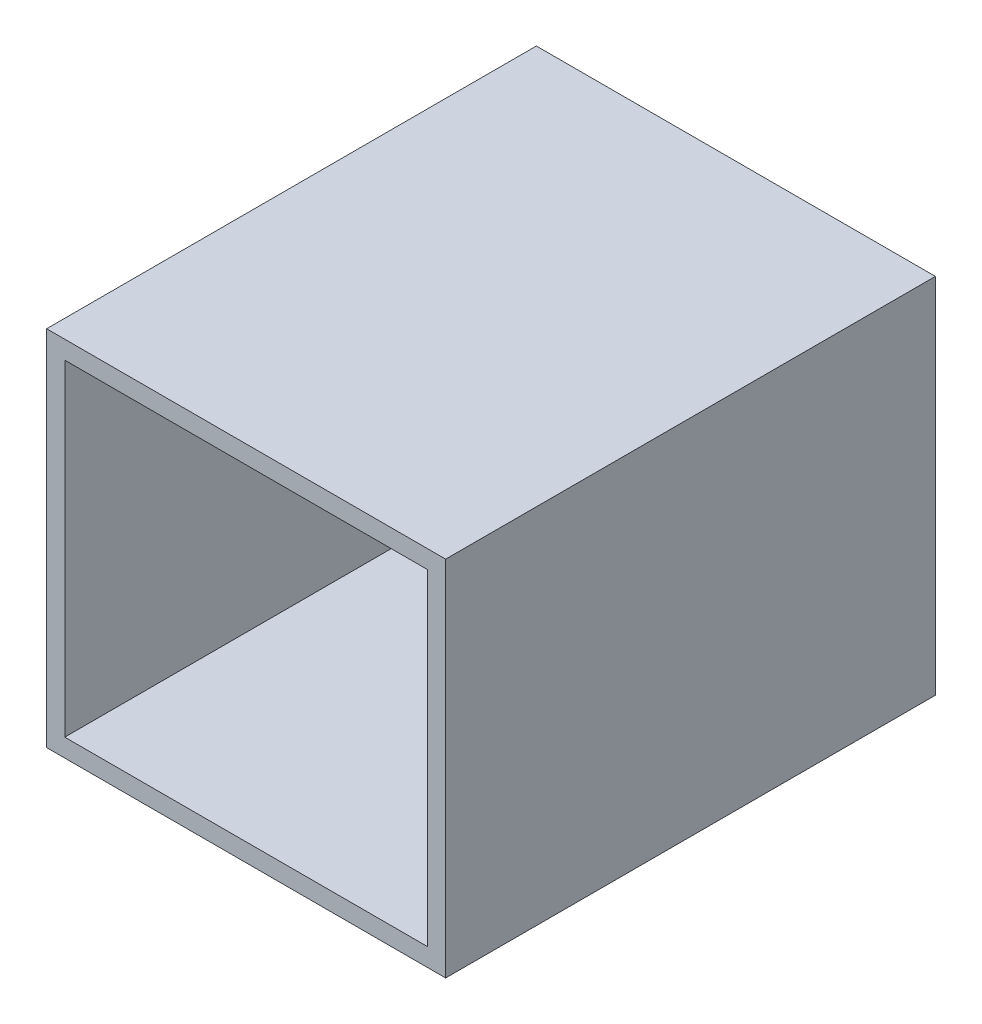
ISO-10303-21;
HEADER;
FILE_DESCRIPTION(('STEP AP214'),'2;1');
FILE_NAME('part.step','',(''),(''),'','','');
FILE_SCHEMA(('AUTOMOTIVE_DESIGN { 1 0 10303 214 1 1 1 1 }'));
ENDSEC;
DATA;
#1=APPLICATION_CONTEXT('core data for automotive mechanical design processes');
#2=APPLICATION_PROTOCOL_DEFINITION('international standard','automotive_design',2000,#1);
#3=PRODUCT_CONTEXT('',#1,'mechanical');
#4=PRODUCT('Part','Part','',(#3));
#5=PRODUCT_RELATED_PRODUCT_CATEGORY('part','',(#4));
#6=PRODUCT_DEFINITION_FORMATION('','',#4);
#7=PRODUCT_DEFINITION_CONTEXT('part definition',#1,'design');
#8=PRODUCT_DEFINITION('design','',#6,#7);
#9=PRODUCT_DEFINITION_SHAPE('','',#8);
#10=(LENGTH_UNIT() NAMED_UNIT(*) SI_UNIT(.MILLI.,.METRE.));
#11=(NAMED_UNIT(*) PLANE_ANGLE_UNIT() SI_UNIT($,.RADIAN.));
#12=(NAMED_UNIT(*) SI_UNIT($,.STERADIAN.) SOLID_ANGLE_UNIT());
#13=UNCERTAINTY_MEASURE_WITH_UNIT(LENGTH_MEASURE(1.E-05),#10,'distance_accuracy_value','');
#14=(GEOMETRIC_REPRESENTATION_CONTEXT(3) GLOBAL_UNCERTAINTY_ASSIGNED_CONTEXT((#13)) GLOBAL_UNIT_ASSIGNED_CONTEXT((#10,
#11,#12)) REPRESENTATION_CONTEXT('',''));
#15=CARTESIAN_POINT('',(0.,0.,0.));
#16=DIRECTION('',(0.,0.,1.));
#17=DIRECTION('',(1.,0.,0.));
#18=AXIS2_PLACEMENT_3D('',#15,#16,#17);
#19=CARTESIAN_POINT('',(11.,-10.,10.));
#20=DIRECTION('',(-1.,0.,0.));
#21=DIRECTION('',(0.,0.,1.));
#22=AXIS2_PLACEMENT_3D('',#19,#20,#21);
#23=PLANE('',#22);
#24=DIRECTION('',(0.,1.,0.));
#25=VECTOR('',#24,1.);
#26=CARTESIAN_POINT('',(11.,0.,-1.));
#27=LINE('',#26,#25);
#28=CARTESIAN_POINT('',(11.,-10.,-1.));
#29=VERTEX_POINT('',#28);
#30=CARTESIAN_POINT('',(11.,10.,-1.));
#31=VERTEX_POINT('',#30);
#32=EDGE_CURVE('E147',#29,#31,#27,.T.);
#33=ORIENTED_EDGE('',*,*,#32,.T.);
#34=DIRECTION('',(0.,0.,-1.));
#35=VECTOR('',#34,1.);
#36=CARTESIAN_POINT('',(11.,10.,10.));
#37=LINE('',#36,#35);
#38=CARTESIAN_POINT('',(11.,10.,26.));
#39=VERTEX_POINT('',#38);
#40=EDGE_CURVE('E11',#39,#31,#37,.T.);
#41=ORIENTED_EDGE('',*,*,#40,.F.);
#42=DIRECTION('',(0.,1.,0.));
#43=VECTOR('',#42,1.);
#44=CARTESIAN_POINT('',(11.,-10.,26.));
#45=LINE('',#44,#43);
#46=CARTESIAN_POINT('',(11.,-10.,26.));
#47=VERTEX_POINT('',#46);
#48=EDGE_CURVE('E125',#47,#39,#45,.T.);
#49=ORIENTED_EDGE('',*,*,#48,.F.);
#50=DIRECTION('',(0.,0.,-1.));
#51=VECTOR('',#50,1.);
#52=CARTESIAN_POINT('',(11.,-10.,10.));
#53=LINE('',#52,#51);
#54=EDGE_CURVE('E106',#47,#29,#53,.T.);
#55=ORIENTED_EDGE('',*,*,#54,.T.);
#56=EDGE_LOOP('',(#33,#41,#49,#55));
#57=FACE_BOUND('',#56,.T.);
#58=ADVANCED_FACE('F35',(#57),#23,.F.);
#59=CARTESIAN_POINT('',(-11.,10.,10.));
#60=DIRECTION('',(0.,-1.,0.));
#61=DIRECTION('',(0.,0.,-1.));
#62=AXIS2_PLACEMENT_3D('',#59,#60,#61);
#63=PLANE('',#62);
#64=DIRECTION('',(1.,0.,0.));
#65=VECTOR('',#64,1.);
#66=CARTESIAN_POINT('',(0.,10.,-1.));
#67=LINE('',#66,#65);
#68=CARTESIAN_POINT('',(-11.,10.,-1.));
#69=VERTEX_POINT('',#68);
#70=EDGE_CURVE('E150',#69,#31,#67,.T.);
#71=ORIENTED_EDGE('',*,*,#70,.F.);
#72=DIRECTION('',(0.,0.,-1.));
#73=VECTOR('',#72,1.);
#74=CARTESIAN_POINT('',(-11.,10.,10.));
#75=LINE('',#74,#73);
#76=CARTESIAN_POINT('',(-11.,10.,26.));
#77=VERTEX_POINT('',#76);
#78=EDGE_CURVE('E42',#77,#69,#75,.T.);
#79=ORIENTED_EDGE('',*,*,#78,.F.);
#80=DIRECTION('',(-1.,0.,0.));
#81=VECTOR('',#80,1.);
#82=CARTESIAN_POINT('',(-11.,10.,26.));
#83=LINE('',#82,#81);
#84=EDGE_CURVE('E128',#39,#77,#83,.T.);
#85=ORIENTED_EDGE('',*,*,#84,.F.);
#86=ORIENTED_EDGE('',*,*,#40,.T.);
#87=EDGE_LOOP('',(#71,#79,#85,#86));
#88=FACE_BOUND('',#87,.T.);
#89=ADVANCED_FACE('F170',(#88),#63,.F.);
#90=CARTESIAN_POINT('',(-11.,-10.,10.));
#91=DIRECTION('',(1.,0.,0.));
#92=DIRECTION('',(0.,0.,-1.));
#93=AXIS2_PLACEMENT_3D('',#90,#91,#92);
#94=PLANE('',#93);
#95=DIRECTION('',(0.,1.,0.));
#96=VECTOR('',#95,1.);
#97=CARTESIAN_POINT('',(-11.,0.,-1.));
#98=LINE('',#97,#96);
#99=CARTESIAN_POINT('',(-11.,-10.,-1.));
#100=VERTEX_POINT('',#99);
#101=EDGE_CURVE('E153',#100,#69,#98,.T.);
#102=ORIENTED_EDGE('',*,*,#101,.F.);
#103=DIRECTION('',(0.,0.,-1.));
#104=VECTOR('',#103,1.);
#105=CARTESIAN_POINT('',(-11.,-10.,10.));
#106=LINE('',#105,#104);
#107=CARTESIAN_POINT('',(-11.,-10.,26.));
#108=VERTEX_POINT('',#107);
#109=EDGE_CURVE('E161',#108,#100,#106,.T.);
#110=ORIENTED_EDGE('',*,*,#109,.F.);
#111=DIRECTION('',(0.,-1.,0.));
#112=VECTOR('',#111,1.);
#113=CARTESIAN_POINT('',(-11.,-10.,26.));
#114=LINE('',#113,#112);
#115=EDGE_CURVE('E131',#77,#108,#114,.T.);
#116=ORIENTED_EDGE('',*,*,#115,.F.);
#117=ORIENTED_EDGE('',*,*,#78,.T.);
#118=EDGE_LOOP('',(#102,#110,#116,#117));
#119=FACE_BOUND('',#118,.T.);
#120=ADVANCED_FACE('F166',(#119),#94,.F.);
#121=CARTESIAN_POINT('',(-11.,-10.,10.));
#122=DIRECTION('',(0.,1.,0.));
#123=DIRECTION('',(0.,0.,1.));
#124=AXIS2_PLACEMENT_3D('',#121,#122,#123);
#125=PLANE('',#124);
#126=DIRECTION('',(1.,0.,0.));
#127=VECTOR('',#126,1.);
#128=CARTESIAN_POINT('',(0.,-10.,-1.));
#129=LINE('',#128,#127);
#130=EDGE_CURVE('E144',#100,#29,#129,.T.);
#131=ORIENTED_EDGE('',*,*,#130,.T.);
#132=ORIENTED_EDGE('',*,*,#54,.F.);
#133=DIRECTION('',(1.,0.,0.));
#134=VECTOR('',#133,1.);
#135=CARTESIAN_POINT('',(-11.,-10.,26.));
#136=LINE('',#135,#134);
#137=EDGE_CURVE('E134',#108,#47,#136,.T.);
#138=ORIENTED_EDGE('',*,*,#137,.F.);
#139=ORIENTED_EDGE('',*,*,#109,.T.);
#140=EDGE_LOOP('',(#131,#132,#138,#139));
#141=FACE_BOUND('',#140,.T.);
#142=ADVANCED_FACE('F175',(#141),#125,.F.);
#143=CARTESIAN_POINT('',(0.,0.,-1.));
#144=DIRECTION('',(0.,0.,1.));
#145=DIRECTION('',(1.,0.,0.));
#146=AXIS2_PLACEMENT_3D('',#143,#144,#145);
#147=PLANE('',#146);
#148=ORIENTED_EDGE('',*,*,#130,.F.);
#149=ORIENTED_EDGE('',*,*,#101,.T.);
#150=ORIENTED_EDGE('',*,*,#70,.T.);
#151=ORIENTED_EDGE('',*,*,#32,.F.);
#152=EDGE_LOOP('',(#148,#149,#150,#151));
#153=FACE_BOUND('',#152,.T.);
#154=ADVANCED_FACE('F173',(#153),#147,.F.);
#155=CARTESIAN_POINT('',(0.,0.,26.));
#156=DIRECTION('',(0.,0.,-1.));
#157=DIRECTION('',(-1.,0.,0.));
#158=AXIS2_PLACEMENT_3D('',#155,#156,#157);
#159=PLANE('',#158);
#160=ORIENTED_EDGE('',*,*,#48,.T.);
#161=ORIENTED_EDGE('',*,*,#84,.T.);
#162=ORIENTED_EDGE('',*,*,#115,.T.);
#163=ORIENTED_EDGE('',*,*,#137,.T.);
#164=EDGE_LOOP('',(#160,#161,#162,#163));
#165=FACE_BOUND('',#164,.T.);
#166=DIRECTION('',(0.,1.,0.));
#167=VECTOR('',#166,1.);
#168=CARTESIAN_POINT('',(10.,-9.,26.));
#169=LINE('',#168,#167);
#170=CARTESIAN_POINT('',(10.,-9.,26.));
#171=VERTEX_POINT('',#170);
#172=CARTESIAN_POINT('',(10.,9.,26.));
#173=VERTEX_POINT('',#172);
#174=EDGE_CURVE('E110',#171,#173,#169,.T.);
#175=ORIENTED_EDGE('',*,*,#174,.F.);
#176=DIRECTION('',(1.,0.,0.));
#177=VECTOR('',#176,1.);
#178=CARTESIAN_POINT('',(-10.,-9.,26.));
#179=LINE('',#178,#177);
#180=CARTESIAN_POINT('',(-10.,-9.,26.));
#181=VERTEX_POINT('',#180);
#182=EDGE_CURVE('E121',#181,#171,#179,.T.);
#183=ORIENTED_EDGE('',*,*,#182,.F.);
#184=DIRECTION('',(0.,-1.,0.));
#185=VECTOR('',#184,1.);
#186=CARTESIAN_POINT('',(-10.,-9.,26.));
#187=LINE('',#186,#185);
#188=CARTESIAN_POINT('',(-10.,9.,26.));
#189=VERTEX_POINT('',#188);
#190=EDGE_CURVE('E119',#189,#181,#187,.T.);
#191=ORIENTED_EDGE('',*,*,#190,.F.);
#192=DIRECTION('',(-1.,0.,0.));
#193=VECTOR('',#192,1.);
#194=CARTESIAN_POINT('',(-10.,9.,26.));
#195=LINE('',#194,#193);
#196=EDGE_CURVE('E101',#173,#189,#195,.T.);
#197=ORIENTED_EDGE('',*,*,#196,.F.);
#198=EDGE_LOOP('',(#175,#183,#191,#197));
#199=FACE_BOUND('',#198,.T.);
#200=ADVANCED_FACE('F117',(#165,#199),#159,.F.);
#201=CARTESIAN_POINT('',(0.,0.,0.));
#202=DIRECTION('',(0.,0.,1.));
#203=DIRECTION('',(1.,0.,0.));
#204=AXIS2_PLACEMENT_3D('',#201,#202,#203);
#205=PLANE('',#204);
#206=DIRECTION('',(1.,0.,0.));
#207=VECTOR('',#206,1.);
#208=CARTESIAN_POINT('',(0.,-9.,0.));
#209=LINE('',#208,#207);
#210=CARTESIAN_POINT('',(-10.,-9.,0.));
#211=VERTEX_POINT('',#210);
#212=CARTESIAN_POINT('',(10.,-9.,0.));
#213=VERTEX_POINT('',#212);
#214=EDGE_CURVE('E137',#211,#213,#209,.T.);
#215=ORIENTED_EDGE('',*,*,#214,.T.);
#216=DIRECTION('',(0.,1.,0.));
#217=VECTOR('',#216,1.);
#218=CARTESIAN_POINT('',(10.,0.,0.));
#219=LINE('',#218,#217);
#220=CARTESIAN_POINT('',(10.,9.,0.));
#221=VERTEX_POINT('',#220);
#222=EDGE_CURVE('E140',#213,#221,#219,.T.);
#223=ORIENTED_EDGE('',*,*,#222,.T.);
#224=DIRECTION('',(1.,0.,0.));
#225=VECTOR('',#224,1.);
#226=CARTESIAN_POINT('',(0.,9.,0.));
#227=LINE('',#226,#225);
#228=CARTESIAN_POINT('',(-10.,9.,0.));
#229=VERTEX_POINT('',#228);
#230=EDGE_CURVE('E49',#229,#221,#227,.T.);
#231=ORIENTED_EDGE('',*,*,#230,.F.);
#232=DIRECTION('',(0.,1.,0.));
#233=VECTOR('',#232,1.);
#234=CARTESIAN_POINT('',(-10.,0.,0.));
#235=LINE('',#234,#233);
#236=EDGE_CURVE('E57',#211,#229,#235,.T.);
#237=ORIENTED_EDGE('',*,*,#236,.F.);
#238=EDGE_LOOP('',(#215,#223,#231,#237));
#239=FACE_BOUND('',#238,.T.);
#240=ADVANCED_FACE('F202',(#239),#205,.T.);
#241=CARTESIAN_POINT('',(-10.,-9.,10.));
#242=DIRECTION('',(0.,1.,0.));
#243=DIRECTION('',(0.,0.,1.));
#244=AXIS2_PLACEMENT_3D('',#241,#242,#243);
#245=PLANE('',#244);
#246=ORIENTED_EDGE('',*,*,#214,.F.);
#247=DIRECTION('',(0.,0.,-1.));
#248=VECTOR('',#247,1.);
#249=CARTESIAN_POINT('',(-10.,-9.,10.));
#250=LINE('',#249,#248);
#251=EDGE_CURVE('E157',#181,#211,#250,.T.);
#252=ORIENTED_EDGE('',*,*,#251,.F.);
#253=ORIENTED_EDGE('',*,*,#182,.T.);
#254=DIRECTION('',(0.,0.,-1.));
#255=VECTOR('',#254,1.);
#256=CARTESIAN_POINT('',(10.,-9.,10.));
#257=LINE('',#256,#255);
#258=EDGE_CURVE('E112',#171,#213,#257,.T.);
#259=ORIENTED_EDGE('',*,*,#258,.T.);
#260=EDGE_LOOP('',(#246,#252,#253,#259));
#261=FACE_BOUND('',#260,.T.);
#262=ADVANCED_FACE('F199',(#261),#245,.T.);
#263=CARTESIAN_POINT('',(-10.,-9.,10.));
#264=DIRECTION('',(1.,0.,0.));
#265=DIRECTION('',(0.,0.,-1.));
#266=AXIS2_PLACEMENT_3D('',#263,#264,#265);
#267=PLANE('',#266);
#268=ORIENTED_EDGE('',*,*,#236,.T.);
#269=DIRECTION('',(0.,0.,-1.));
#270=VECTOR('',#269,1.);
#271=CARTESIAN_POINT('',(-10.,9.,10.));
#272=LINE('',#271,#270);
#273=EDGE_CURVE('E107',#189,#229,#272,.T.);
#274=ORIENTED_EDGE('',*,*,#273,.F.);
#275=ORIENTED_EDGE('',*,*,#190,.T.);
#276=ORIENTED_EDGE('',*,*,#251,.T.);
#277=EDGE_LOOP('',(#268,#274,#275,#276));
#278=FACE_BOUND('',#277,.T.);
#279=ADVANCED_FACE('F196',(#278),#267,.T.);
#280=CARTESIAN_POINT('',(-10.,9.,10.));
#281=DIRECTION('',(0.,-1.,0.));
#282=DIRECTION('',(0.,0.,-1.));
#283=AXIS2_PLACEMENT_3D('',#280,#281,#282);
#284=PLANE('',#283);
#285=ORIENTED_EDGE('',*,*,#230,.T.);
#286=DIRECTION('',(0.,0.,-1.));
#287=VECTOR('',#286,1.);
#288=CARTESIAN_POINT('',(10.,9.,10.));
#289=LINE('',#288,#287);
#290=EDGE_CURVE('E97',#173,#221,#289,.T.);
#291=ORIENTED_EDGE('',*,*,#290,.F.);
#292=ORIENTED_EDGE('',*,*,#196,.T.);
#293=ORIENTED_EDGE('',*,*,#273,.T.);
#294=EDGE_LOOP('',(#285,#291,#292,#293));
#295=FACE_BOUND('',#294,.T.);
#296=ADVANCED_FACE('F99',(#295),#284,.T.);
#297=CARTESIAN_POINT('',(10.,-9.,10.));
#298=DIRECTION('',(-1.,0.,0.));
#299=DIRECTION('',(0.,0.,1.));
#300=AXIS2_PLACEMENT_3D('',#297,#298,#299);
#301=PLANE('',#300);
#302=ORIENTED_EDGE('',*,*,#222,.F.);
#303=ORIENTED_EDGE('',*,*,#258,.F.);
#304=ORIENTED_EDGE('',*,*,#174,.T.);
#305=ORIENTED_EDGE('',*,*,#290,.T.);
#306=EDGE_LOOP('',(#302,#303,#304,#305));
#307=FACE_BOUND('',#306,.T.);
#308=ADVANCED_FACE('F111',(#307),#301,.T.);
#309=CLOSED_SHELL('',(#58,#89,#120,#142,#154,#200,#240,#262,#279,#296,#308));
#310=MANIFOLD_SOLID_BREP('B2',#309);
#311=ADVANCED_BREP_SHAPE_REPRESENTATION('',(#18,#310),#14);
#312=SHAPE_DEFINITION_REPRESENTATION(#9,#311);
ENDSEC;
END-ISO-10303-21;
